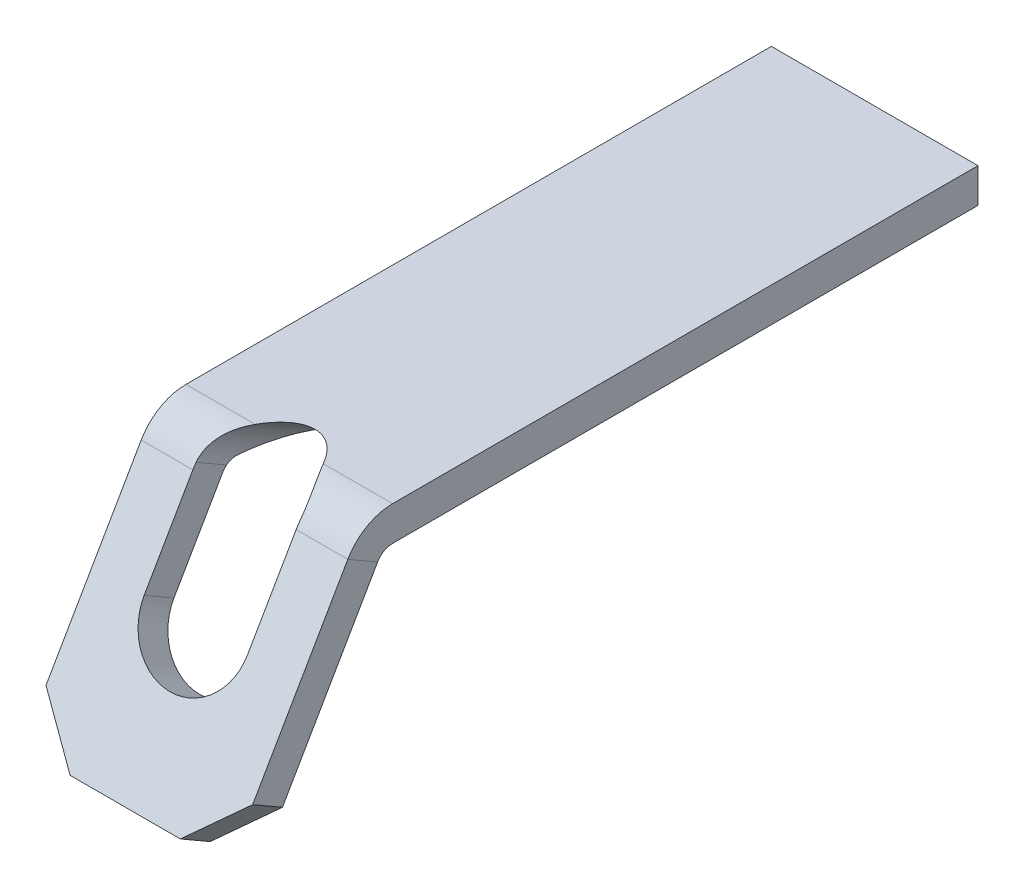
ISO-10303-21;
HEADER;
FILE_DESCRIPTION(('STEP AP214'),'2;1');
FILE_NAME('part.step','',(''),(''),'','','');
FILE_SCHEMA(('AUTOMOTIVE_DESIGN { 1 0 10303 214 1 1 1 1 }'));
ENDSEC;
DATA;
#1=APPLICATION_CONTEXT('core data for automotive mechanical design processes');
#2=APPLICATION_PROTOCOL_DEFINITION('international standard','automotive_design',2000,#1);
#3=PRODUCT_CONTEXT('',#1,'mechanical');
#4=PRODUCT('Part','Part','',(#3));
#5=PRODUCT_RELATED_PRODUCT_CATEGORY('part','',(#4));
#6=PRODUCT_DEFINITION_FORMATION('','',#4);
#7=PRODUCT_DEFINITION_CONTEXT('part definition',#1,'design');
#8=PRODUCT_DEFINITION('design','',#6,#7);
#9=PRODUCT_DEFINITION_SHAPE('','',#8);
#10=(LENGTH_UNIT() NAMED_UNIT(*) SI_UNIT(.MILLI.,.METRE.));
#11=(NAMED_UNIT(*) PLANE_ANGLE_UNIT() SI_UNIT($,.RADIAN.));
#12=(NAMED_UNIT(*) SI_UNIT($,.STERADIAN.) SOLID_ANGLE_UNIT());
#13=UNCERTAINTY_MEASURE_WITH_UNIT(LENGTH_MEASURE(1.E-05),#10,'distance_accuracy_value','');
#14=(GEOMETRIC_REPRESENTATION_CONTEXT(3) GLOBAL_UNCERTAINTY_ASSIGNED_CONTEXT((#13)) GLOBAL_UNIT_ASSIGNED_CONTEXT((#10,
#11,#12)) REPRESENTATION_CONTEXT('',''));
#15=CARTESIAN_POINT('',(0.,0.,0.));
#16=DIRECTION('',(0.,0.,1.));
#17=DIRECTION('',(1.,0.,0.));
#18=AXIS2_PLACEMENT_3D('',#15,#16,#17);
#19=CARTESIAN_POINT('',(0.,-0.5,4.25));
#20=DIRECTION('',(1.,0.,0.));
#21=DIRECTION('',(0.,0.,-1.));
#22=AXIS2_PLACEMENT_3D('',#19,#20,#21);
#23=CYLINDRICAL_SURFACE('',#22,0.25);
#24=CARTESIAN_POINT('',(0.738540154084688,-0.25,4.25));
#25=CARTESIAN_POINT('',(0.739796227190586,-0.249992222476748,4.26423192600012));
#26=CARTESIAN_POINT('',(0.741136393695474,-0.251215674942695,4.27845228618072));
#27=CARTESIAN_POINT('',(0.743704492818735,-0.255982139403662,4.30608304503192));
#28=CARTESIAN_POINT('',(0.74493454642555,-0.2594573169147,4.31950497559517));
#29=CARTESIAN_POINT('',(0.747172335123278,-0.268891956089954,4.34646595481917));
#30=CARTESIAN_POINT('',(0.748160348429003,-0.274998607282581,4.35995559261057));
#31=CARTESIAN_POINT('',(0.749588900459598,-0.289725386987503,4.38608332336731));
#32=CARTESIAN_POINT('',(0.750011148585141,-0.298418856822308,4.3986810266524));
#33=CARTESIAN_POINT('',(0.75,-0.308220009215909,4.41037591818866));
#34=B_SPLINE_CURVE_WITH_KNOTS('',3,(#24,#25,#26,#27,#28,#29,#30,#31,#32,#33),.UNSPECIFIED.,.F.,
.F.,(4,2,2,2,4),(0.,0.0428026914059938,0.0843723717900828,0.128652135829097,0.174331417159321),.UNSPECIFIED.);
#35=CARTESIAN_POINT('',(0.738540154084688,-0.25,4.25));
#36=VERTEX_POINT('',#35);
#37=CARTESIAN_POINT('',(0.75,-0.308220009215908,4.41037591818866));
#38=VERTEX_POINT('',#37);
#39=EDGE_CURVE('E322',#36,#38,#34,.T.);
#40=ORIENTED_EDGE('',*,*,#39,.F.);
#41=DIRECTION('',(1.,0.,0.));
#42=VECTOR('',#41,1.);
#43=CARTESIAN_POINT('',(-1.5,-0.25,4.25));
#44=LINE('',#43,#42);
#45=CARTESIAN_POINT('',(1.5,-0.25,4.25));
#46=VERTEX_POINT('',#45);
#47=EDGE_CURVE('E321',#36,#46,#44,.T.);
#48=ORIENTED_EDGE('',*,*,#47,.T.);
#49=CARTESIAN_POINT('',(1.5,-0.5,4.25));
#50=DIRECTION('',(1.,0.,0.));
#51=DIRECTION('',(0.,1.,0.));
#52=AXIS2_PLACEMENT_3D('',#49,#50,#51);
#53=CIRCLE('',#52,0.25);
#54=CARTESIAN_POINT('',(1.5,-0.375,4.46650635094611));
#55=VERTEX_POINT('',#54);
#56=EDGE_CURVE('E348',#46,#55,#53,.T.);
#57=ORIENTED_EDGE('',*,*,#56,.T.);
#58=DIRECTION('',(1.,0.,0.));
#59=VECTOR('',#58,1.);
#60=CARTESIAN_POINT('',(-1.5,-0.375,4.46650635094611));
#61=LINE('',#60,#59);
#62=CARTESIAN_POINT('',(0.75,-0.375,4.46650635094611));
#63=VERTEX_POINT('',#62);
#64=EDGE_CURVE('E337',#63,#55,#61,.T.);
#65=ORIENTED_EDGE('',*,*,#64,.F.);
#66=CARTESIAN_POINT('',(0.75,-0.5,4.25));
#67=DIRECTION('',(1.,0.,0.));
#68=DIRECTION('',(0.,0.,-1.));
#69=AXIS2_PLACEMENT_3D('',#66,#67,#68);
#70=CIRCLE('',#69,0.25);
#71=EDGE_CURVE('E208',#38,#63,#70,.T.);
#72=ORIENTED_EDGE('',*,*,#71,.F.);
#73=EDGE_LOOP('',(#40,#48,#57,#65,#72));
#74=FACE_BOUND('',#73,.T.);
#75=ADVANCED_FACE('F37',(#74),#23,.F.);
#76=CARTESIAN_POINT('',(0.,-0.5,4.25));
#77=DIRECTION('',(1.,0.,0.));
#78=DIRECTION('',(0.,0.,-1.));
#79=AXIS2_PLACEMENT_3D('',#76,#77,#78);
#80=CYLINDRICAL_SURFACE('',#79,0.75);
#81=CARTESIAN_POINT('',(0.75,-0.0530774463347981,4.85229580027208));
#82=CARTESIAN_POINT('',(0.750002475309161,-0.0390500007812527,4.84189012408484));
#83=CARTESIAN_POINT('',(0.749397484850658,-0.0253996458115997,4.83099771523583));
#84=CARTESIAN_POINT('',(0.747030547301498,0.00104006971930772,4.8083555069125));
#85=CARTESIAN_POINT('',(0.745269813605595,0.0138303177827564,4.79660661812892));
#86=CARTESIAN_POINT('',(0.738388136393959,0.0505308719127275,4.7604737016062));
#87=CARTESIAN_POINT('',(0.731665075692414,0.0730740166895009,4.73497676608455));
#88=CARTESIAN_POINT('',(0.714670479663492,0.113924752364809,4.68210224166803));
#89=CARTESIAN_POINT('',(0.704412929418581,0.132248568388786,4.65473240041221));
#90=CARTESIAN_POINT('',(0.681092480512217,0.164811508788652,4.59868326911695));
#91=CARTESIAN_POINT('',(0.668020265449992,0.179036692146175,4.56999988576025));
#92=CARTESIAN_POINT('',(0.63361768347433,0.2088635379017,4.49914580377907));
#93=CARTESIAN_POINT('',(0.611187373419911,0.222307050936848,4.45660414355653));
#94=CARTESIAN_POINT('',(0.564129396140941,0.241456718121171,4.37110856302409));
#95=CARTESIAN_POINT('',(0.539503361307708,0.247168570016325,4.3281549698181));
#96=CARTESIAN_POINT('',(0.508168812013807,0.249724148600028,4.27340370863223));
#97=CARTESIAN_POINT('',(0.501476538124168,0.249996949131605,4.26170462495713));
#98=CARTESIAN_POINT('',(0.494804752028709,0.250000000000006,4.25));
#99=B_SPLINE_CURVE_WITH_KNOTS('',3,(#81,#82,#83,#84,#85,#86,#87,#88,#89,#90,#91,#92,#93,#94,#95,
#96,#97,#98),.UNSPECIFIED.,.F.,.F.,(4,2,2,2,2,2,2,2,4),(0.,0.0523524240966635,0.104649972016483,
0.208128032232243,0.311201270134959,0.4146210689264,0.563636486235141,0.712542028697262,
0.752971410406567),.UNSPECIFIED.);
#100=CARTESIAN_POINT('',(0.75,-0.0530774463347985,4.85229580027207));
#101=VERTEX_POINT('',#100);
#102=CARTESIAN_POINT('',(0.494804752028707,0.25,4.25));
#103=VERTEX_POINT('',#102);
#104=EDGE_CURVE('E247',#101,#103,#99,.T.);
#105=ORIENTED_EDGE('',*,*,#104,.F.);
#106=CARTESIAN_POINT('',(0.75,-0.5,4.25));
#107=DIRECTION('',(1.,0.,0.));
#108=DIRECTION('',(0.,0.,-1.));
#109=AXIS2_PLACEMENT_3D('',#106,#107,#108);
#110=CIRCLE('',#109,0.75);
#111=CARTESIAN_POINT('',(0.75,-0.125000000000001,4.89951905283833));
#112=VERTEX_POINT('',#111);
#113=EDGE_CURVE('E210',#112,#101,#110,.F.);
#114=ORIENTED_EDGE('',*,*,#113,.F.);
#115=DIRECTION('',(-1.,0.,0.));
#116=VECTOR('',#115,1.);
#117=CARTESIAN_POINT('',(1.5,-0.125000000000001,4.89951905283833));
#118=LINE('',#117,#116);
#119=CARTESIAN_POINT('',(1.5,-0.125000000000001,4.89951905283833));
#120=VERTEX_POINT('',#119);
#121=EDGE_CURVE('E345',#120,#112,#118,.T.);
#122=ORIENTED_EDGE('',*,*,#121,.F.);
#123=CARTESIAN_POINT('',(1.5,-0.5,4.25));
#124=DIRECTION('',(1.,0.,0.));
#125=DIRECTION('',(0.,1.,0.));
#126=AXIS2_PLACEMENT_3D('',#123,#124,#125);
#127=CIRCLE('',#126,0.75);
#128=CARTESIAN_POINT('',(1.5,0.25,4.25));
#129=VERTEX_POINT('',#128);
#130=EDGE_CURVE('E359',#129,#120,#127,.T.);
#131=ORIENTED_EDGE('',*,*,#130,.F.);
#132=DIRECTION('',(1.,0.,0.));
#133=VECTOR('',#132,1.);
#134=CARTESIAN_POINT('',(-1.5,0.25,4.25));
#135=LINE('',#134,#133);
#136=EDGE_CURVE('E376',#103,#129,#135,.T.);
#137=ORIENTED_EDGE('',*,*,#136,.F.);
#138=EDGE_LOOP('',(#105,#114,#122,#131,#137));
#139=FACE_BOUND('',#138,.T.);
#140=ADVANCED_FACE('F261',(#139),#80,.T.);
#141=CARTESIAN_POINT('',(1.5,0.25,-4.25));
#142=DIRECTION('',(-1.,0.,0.));
#143=DIRECTION('',(0.,0.,1.));
#144=AXIS2_PLACEMENT_3D('',#141,#142,#143);
#145=PLANE('',#144);
#146=DIRECTION('',(0.,0.,-1.));
#147=VECTOR('',#146,1.);
#148=CARTESIAN_POINT('',(1.5,-0.25,-4.25));
#149=LINE('',#148,#147);
#150=CARTESIAN_POINT('',(1.5,-0.25,-4.25));
#151=VERTEX_POINT('',#150);
#152=EDGE_CURVE('E368',#46,#151,#149,.T.);
#153=ORIENTED_EDGE('',*,*,#152,.T.);
#154=DIRECTION('',(0.,-1.,0.));
#155=VECTOR('',#154,1.);
#156=CARTESIAN_POINT('',(1.5,0.25,-4.25));
#157=LINE('',#156,#155);
#158=CARTESIAN_POINT('',(1.5,0.25,-4.25));
#159=VERTEX_POINT('',#158);
#160=EDGE_CURVE('E186',#159,#151,#157,.T.);
#161=ORIENTED_EDGE('',*,*,#160,.F.);
#162=DIRECTION('',(0.,0.,-1.));
#163=VECTOR('',#162,1.);
#164=CARTESIAN_POINT('',(1.5,0.25,-4.25));
#165=LINE('',#164,#163);
#166=EDGE_CURVE('E369',#129,#159,#165,.T.);
#167=ORIENTED_EDGE('',*,*,#166,.F.);
#168=ORIENTED_EDGE('',*,*,#130,.T.);
#169=DIRECTION('',(0.,0.5,0.866025403784439));
#170=VECTOR('',#169,1.);
#171=CARTESIAN_POINT('',(1.5,-0.375,4.46650635094611));
#172=LINE('',#171,#170);
#173=EDGE_CURVE('E351',#55,#120,#172,.T.);
#174=ORIENTED_EDGE('',*,*,#173,.F.);
#175=ORIENTED_EDGE('',*,*,#56,.F.);
#176=EDGE_LOOP('',(#153,#161,#167,#168,#174,#175));
#177=FACE_BOUND('',#176,.T.);
#178=ADVANCED_FACE('F284',(#177),#145,.F.);
#179=CARTESIAN_POINT('',(-1.5,0.25,-4.25));
#180=DIRECTION('',(0.,0.,1.));
#181=DIRECTION('',(1.,0.,0.));
#182=AXIS2_PLACEMENT_3D('',#179,#180,#181);
#183=PLANE('',#182);
#184=DIRECTION('',(-1.,0.,0.));
#185=VECTOR('',#184,1.);
#186=CARTESIAN_POINT('',(-1.5,-0.25,-4.25));
#187=LINE('',#186,#185);
#188=CARTESIAN_POINT('',(-1.5,-0.25,-4.25));
#189=VERTEX_POINT('',#188);
#190=EDGE_CURVE('E383',#151,#189,#187,.T.);
#191=ORIENTED_EDGE('',*,*,#190,.T.);
#192=DIRECTION('',(0.,-1.,0.));
#193=VECTOR('',#192,1.);
#194=CARTESIAN_POINT('',(-1.5,0.25,-4.25));
#195=LINE('',#194,#193);
#196=CARTESIAN_POINT('',(-1.5,0.25,-4.25));
#197=VERTEX_POINT('',#196);
#198=EDGE_CURVE('E380',#197,#189,#195,.T.);
#199=ORIENTED_EDGE('',*,*,#198,.F.);
#200=DIRECTION('',(-1.,0.,0.));
#201=VECTOR('',#200,1.);
#202=CARTESIAN_POINT('',(-1.5,0.25,-4.25));
#203=LINE('',#202,#201);
#204=EDGE_CURVE('E372',#159,#197,#203,.T.);
#205=ORIENTED_EDGE('',*,*,#204,.F.);
#206=ORIENTED_EDGE('',*,*,#160,.T.);
#207=EDGE_LOOP('',(#191,#199,#205,#206));
#208=FACE_BOUND('',#207,.T.);
#209=ADVANCED_FACE('F280',(#208),#183,.F.);
#210=CARTESIAN_POINT('',(-1.5,0.25,-4.25));
#211=DIRECTION('',(1.,0.,0.));
#212=DIRECTION('',(0.,0.,-1.));
#213=AXIS2_PLACEMENT_3D('',#210,#211,#212);
#214=PLANE('',#213);
#215=DIRECTION('',(0.,0.,1.));
#216=VECTOR('',#215,1.);
#217=CARTESIAN_POINT('',(-1.5,-0.25,-4.25));
#218=LINE('',#217,#216);
#219=CARTESIAN_POINT('',(-1.5,-0.25,4.25));
#220=VERTEX_POINT('',#219);
#221=EDGE_CURVE('E385',#189,#220,#218,.T.);
#222=ORIENTED_EDGE('',*,*,#221,.T.);
#223=CARTESIAN_POINT('',(-1.5,-0.5,4.25));
#224=DIRECTION('',(1.,0.,0.));
#225=DIRECTION('',(0.,1.,0.));
#226=AXIS2_PLACEMENT_3D('',#223,#224,#225);
#227=CIRCLE('',#226,0.25);
#228=CARTESIAN_POINT('',(-1.5,-0.375,4.46650635094611));
#229=VERTEX_POINT('',#228);
#230=EDGE_CURVE('E335',#220,#229,#227,.T.);
#231=ORIENTED_EDGE('',*,*,#230,.T.);
#232=DIRECTION('',(0.,-0.5,-0.866025403784439));
#233=VECTOR('',#232,1.);
#234=CARTESIAN_POINT('',(-1.5,-0.125000000000001,4.89951905283833));
#235=LINE('',#234,#233);
#236=CARTESIAN_POINT('',(-1.5,-0.125000000000001,4.89951905283833));
#237=VERTEX_POINT('',#236);
#238=EDGE_CURVE('E326',#237,#229,#235,.T.);
#239=ORIENTED_EDGE('',*,*,#238,.F.);
#240=CARTESIAN_POINT('',(-1.5,-0.5,4.25));
#241=DIRECTION('',(1.,0.,0.));
#242=DIRECTION('',(0.,1.,0.));
#243=AXIS2_PLACEMENT_3D('',#240,#241,#242);
#244=CIRCLE('',#243,0.75);
#245=CARTESIAN_POINT('',(-1.5,0.25,4.25));
#246=VERTEX_POINT('',#245);
#247=EDGE_CURVE('E323',#246,#237,#244,.T.);
#248=ORIENTED_EDGE('',*,*,#247,.F.);
#249=DIRECTION('',(0.,0.,1.));
#250=VECTOR('',#249,1.);
#251=CARTESIAN_POINT('',(-1.5,0.25,-4.25));
#252=LINE('',#251,#250);
#253=EDGE_CURVE('E374',#197,#246,#252,.T.);
#254=ORIENTED_EDGE('',*,*,#253,.F.);
#255=ORIENTED_EDGE('',*,*,#198,.T.);
#256=EDGE_LOOP('',(#222,#231,#239,#248,#254,#255));
#257=FACE_BOUND('',#256,.T.);
#258=ADVANCED_FACE('F273',(#257),#214,.F.);
#259=CARTESIAN_POINT('',(0.,0.25,0.));
#260=DIRECTION('',(0.,1.,0.));
#261=DIRECTION('',(0.,0.,1.));
#262=AXIS2_PLACEMENT_3D('',#259,#260,#261);
#263=PLANE('',#262);
#264=CARTESIAN_POINT('',(0.,0.25,5.37724133595217));
#265=DIRECTION('',(0.,1.,0.));
#266=DIRECTION('',(0.,0.,1.));
#267=AXIS2_PLACEMENT_3D('',#264,#265,#266);
#268=ELLIPSE('',#267,1.5,0.75);
#269=CARTESIAN_POINT('',(-0.494804752028707,0.25,4.25));
#270=VERTEX_POINT('',#269);
#271=EDGE_CURVE('E212',#103,#270,#268,.T.);
#272=ORIENTED_EDGE('',*,*,#271,.F.);
#273=ORIENTED_EDGE('',*,*,#136,.T.);
#274=ORIENTED_EDGE('',*,*,#166,.T.);
#275=ORIENTED_EDGE('',*,*,#204,.T.);
#276=ORIENTED_EDGE('',*,*,#253,.T.);
#277=EDGE_CURVE('E377',#246,#270,#135,.T.);
#278=ORIENTED_EDGE('',*,*,#277,.T.);
#279=EDGE_LOOP('',(#272,#273,#274,#275,#276,#278));
#280=FACE_BOUND('',#279,.T.);
#281=ADVANCED_FACE('F270',(#280),#263,.T.);
#282=CARTESIAN_POINT('',(0.,-0.25,0.));
#283=DIRECTION('',(0.,1.,0.));
#284=DIRECTION('',(0.,0.,1.));
#285=AXIS2_PLACEMENT_3D('',#282,#283,#284);
#286=PLANE('',#285);
#287=ORIENTED_EDGE('',*,*,#47,.F.);
#288=CARTESIAN_POINT('',(0.,-0.25,4.51121593216774));
#289=DIRECTION('',(0.,1.,0.));
#290=DIRECTION('',(0.,0.,1.));
#291=AXIS2_PLACEMENT_3D('',#288,#289,#290);
#292=ELLIPSE('',#291,1.5,0.75);
#293=CARTESIAN_POINT('',(-0.738540154084688,-0.25,4.25));
#294=VERTEX_POINT('',#293);
#295=EDGE_CURVE('E222',#36,#294,#292,.T.);
#296=ORIENTED_EDGE('',*,*,#295,.T.);
#297=EDGE_CURVE('E314',#220,#294,#44,.T.);
#298=ORIENTED_EDGE('',*,*,#297,.F.);
#299=ORIENTED_EDGE('',*,*,#221,.F.);
#300=ORIENTED_EDGE('',*,*,#190,.F.);
#301=ORIENTED_EDGE('',*,*,#152,.F.);
#302=EDGE_LOOP('',(#287,#296,#298,#299,#300,#301));
#303=FACE_BOUND('',#302,.T.);
#304=ADVANCED_FACE('F266',(#303),#286,.F.);
#305=CARTESIAN_POINT('',(0.,-3.25,6.4150635094611));
#306=DIRECTION('',(0.,-0.866025403784438,0.500000000000001));
#307=DIRECTION('',(1.,0.,0.));
#308=AXIS2_PLACEMENT_3D('',#305,#306,#307);
#309=PLANE('',#308);
#310=DIRECTION('',(1.,0.,0.));
#311=VECTOR('',#310,1.);
#312=CARTESIAN_POINT('',(-1.5,-3.375,6.198557158515));
#313=LINE('',#312,#311);
#314=CARTESIAN_POINT('',(-0.799999999999998,-3.375,6.198557158515));
#315=VERTEX_POINT('',#314);
#316=CARTESIAN_POINT('',(0.8,-3.375,6.198557158515));
#317=VERTEX_POINT('',#316);
#318=EDGE_CURVE('E341',#315,#317,#313,.T.);
#319=ORIENTED_EDGE('',*,*,#318,.T.);
#320=DIRECTION('',(0.,0.500000000000001,0.866025403784438));
#321=VECTOR('',#320,1.);
#322=CARTESIAN_POINT('',(0.8,-3.25,6.4150635094611));
#323=LINE('',#322,#321);
#324=CARTESIAN_POINT('',(0.8,-3.125,6.63156986040721));
#325=VERTEX_POINT('',#324);
#326=EDGE_CURVE('E407',#317,#325,#323,.T.);
#327=ORIENTED_EDGE('',*,*,#326,.T.);
#328=DIRECTION('',(-1.,0.,0.));
#329=VECTOR('',#328,1.);
#330=CARTESIAN_POINT('',(1.5,-3.125,6.63156986040721));
#331=LINE('',#330,#329);
#332=CARTESIAN_POINT('',(-0.799999999999998,-3.125,6.63156986040721));
#333=VERTEX_POINT('',#332);
#334=EDGE_CURVE('E364',#325,#333,#331,.T.);
#335=ORIENTED_EDGE('',*,*,#334,.T.);
#336=DIRECTION('',(0.,-0.500000000000001,-0.866025403784438));
#337=VECTOR('',#336,1.);
#338=CARTESIAN_POINT('',(-0.799999999999998,-3.25,6.4150635094611));
#339=LINE('',#338,#337);
#340=EDGE_CURVE('E253',#333,#315,#339,.T.);
#341=ORIENTED_EDGE('',*,*,#340,.T.);
#342=EDGE_LOOP('',(#319,#327,#335,#341));
#343=FACE_BOUND('',#342,.T.);
#344=ADVANCED_FACE('F234',(#343),#309,.T.);
#345=CARTESIAN_POINT('',(-0.75,-0.308220009215908,4.41037591818866));
#346=CARTESIAN_POINT('',(-0.750008310530121,-0.299170345690206,4.39957110118343));
#347=CARTESIAN_POINT('',(-0.7496493719506,-0.291061551564701,4.38799997393136));
#348=CARTESIAN_POINT('',(-0.748415678099862,-0.277104423632904,4.36403100034418));
#349=CARTESIAN_POINT('',(-0.747555891577427,-0.271198332145317,4.35166604883466));
#350=CARTESIAN_POINT('',(-0.745421239101967,-0.261037124809497,4.32496342703673));
#351=CARTESIAN_POINT('',(-0.744115010283401,-0.256988760900442,4.31054949871758));
#352=CARTESIAN_POINT('',(-0.741355473168162,-0.25142101625551,4.28077071335262));
#353=CARTESIAN_POINT('',(-0.739898791250124,-0.249986913345264,4.26539018443887));
#354=CARTESIAN_POINT('',(-0.738540154084688,-0.25,4.25));
#355=B_SPLINE_CURVE_WITH_KNOTS('',3,(#345,#346,#347,#348,#349,#350,#351,#352,#353,#354),
.UNSPECIFIED.,.F.,.F.,(4,2,2,2,4),(0.,0.0422016336722642,0.0832023760305246,0.128047888733355,
0.174331752280167),.UNSPECIFIED.);
#356=CARTESIAN_POINT('',(-0.75,-0.308220009215908,4.41037591818866));
#357=VERTEX_POINT('',#356);
#358=EDGE_CURVE('E214',#357,#294,#355,.T.);
#359=ORIENTED_EDGE('',*,*,#358,.F.);
#360=CARTESIAN_POINT('',(-0.75,-0.5,4.25));
#361=DIRECTION('',(-1.,0.,0.));
#362=DIRECTION('',(0.,-1.,0.));
#363=AXIS2_PLACEMENT_3D('',#360,#361,#362);
#364=CIRCLE('',#363,0.25);
#365=CARTESIAN_POINT('',(-0.75,-0.375,4.46650635094611));
#366=VERTEX_POINT('',#365);
#367=EDGE_CURVE('E202',#366,#357,#364,.T.);
#368=ORIENTED_EDGE('',*,*,#367,.F.);
#369=EDGE_CURVE('E346',#229,#366,#61,.T.);
#370=ORIENTED_EDGE('',*,*,#369,.F.);
#371=ORIENTED_EDGE('',*,*,#230,.F.);
#372=ORIENTED_EDGE('',*,*,#297,.T.);
#373=EDGE_LOOP('',(#359,#368,#370,#371,#372));
#374=FACE_BOUND('',#373,.T.);
#375=ADVANCED_FACE('F224',(#374),#23,.F.);
#376=CARTESIAN_POINT('',(-0.494804752028707,0.25,4.25));
#377=CARTESIAN_POINT('',(-0.507212223849995,0.24999104936502,4.27176544478382));
#378=CARTESIAN_POINT('',(-0.519677329562981,0.249052174133644,4.29348153759597));
#379=CARTESIAN_POINT('',(-0.544476505895984,0.245273819176751,4.33686353730328));
#380=CARTESIAN_POINT('',(-0.556810364065535,0.242431628285439,4.35852932830796));
#381=CARTESIAN_POINT('',(-0.593492984985001,0.230897623169133,4.42397071088134));
#382=CARTESIAN_POINT('',(-0.617199549117097,0.219196023208876,4.46764754407431));
#383=CARTESIAN_POINT('',(-0.655369353049871,0.191156681794535,4.54326612847591));
#384=CARTESIAN_POINT('',(-0.670675057728904,0.176653514513336,4.57546468892482));
#385=CARTESIAN_POINT('',(-0.697958612412823,0.142647605295805,4.63828922937357));
#386=CARTESIAN_POINT('',(-0.70996212874235,0.123185827280292,4.66892573721418));
#387=CARTESIAN_POINT('',(-0.729340509733132,0.0800406667948656,4.72675752132392));
#388=CARTESIAN_POINT('',(-0.736878604418717,0.0565530386505959,4.75404068185705));
#389=CARTESIAN_POINT('',(-0.744635583122395,0.0179834450445735,4.79270929564723));
#390=CARTESIAN_POINT('',(-0.746630830911752,0.00444936512402553,4.80531366677174));
#391=CARTESIAN_POINT('',(-0.749315579530813,-0.0236048687245404,4.82956257178275));
#392=CARTESIAN_POINT('',(-0.750003338619623,-0.0381263113268377,4.84120580560175));
#393=CARTESIAN_POINT('',(-0.75,-0.0530774463347993,4.85229580027208));
#394=B_SPLINE_CURVE_WITH_KNOTS('',3,(#376,#377,#378,#379,#380,#381,#382,#383,#384,#385,#386,
#387,#388,#389,#390,#391,#392,#393),.UNSPECIFIED.,.F.,.F.,(4,2,2,2,2,2,2,2,4),(0.,
0.0751135104377852,0.150334244069228,0.302651785589941,0.417705443137115,0.531837811097346,
0.641489009411778,0.697207014432039,0.752999191038594),.UNSPECIFIED.);
#395=CARTESIAN_POINT('',(-0.75,-0.0530774463347985,4.85229580027207));
#396=VERTEX_POINT('',#395);
#397=EDGE_CURVE('E185',#270,#396,#394,.T.);
#398=ORIENTED_EDGE('',*,*,#397,.F.);
#399=ORIENTED_EDGE('',*,*,#277,.F.);
#400=ORIENTED_EDGE('',*,*,#247,.T.);
#401=CARTESIAN_POINT('',(-0.75,-0.125000000000001,4.89951905283833));
#402=VERTEX_POINT('',#401);
#403=EDGE_CURVE('E362',#402,#237,#118,.T.);
#404=ORIENTED_EDGE('',*,*,#403,.F.);
#405=CARTESIAN_POINT('',(-0.75,-0.5,4.25));
#406=DIRECTION('',(-1.,0.,0.));
#407=DIRECTION('',(0.,-1.,0.));
#408=AXIS2_PLACEMENT_3D('',#405,#406,#407);
#409=CIRCLE('',#408,0.75);
#410=EDGE_CURVE('E182',#396,#402,#409,.F.);
#411=ORIENTED_EDGE('',*,*,#410,.F.);
#412=EDGE_LOOP('',(#398,#399,#400,#404,#411));
#413=FACE_BOUND('',#412,.T.);
#414=ADVANCED_FACE('F255',(#413),#80,.T.);
#415=CARTESIAN_POINT('',(-1.5,-0.125,4.89951905283833));
#416=DIRECTION('',(-1.,0.,0.));
#417=DIRECTION('',(0.,0.,1.));
#418=AXIS2_PLACEMENT_3D('',#415,#416,#417);
#419=PLANE('',#418);
#420=DIRECTION('',(0.,-0.866025403784438,0.500000000000001));
#421=VECTOR('',#420,1.);
#422=CARTESIAN_POINT('',(-1.5,-0.375,4.46650635094611));
#423=LINE('',#422,#421);
#424=CARTESIAN_POINT('',(-1.5,-2.76878221735089,5.84855715851499));
#425=VERTEX_POINT('',#424);
#426=EDGE_CURVE('E339',#229,#425,#423,.T.);
#427=ORIENTED_EDGE('',*,*,#426,.T.);
#428=DIRECTION('',(0.,0.500000000000001,0.866025403784438));
#429=VECTOR('',#428,1.);
#430=CARTESIAN_POINT('',(-1.5,-2.51878221735089,6.28156986040721));
#431=LINE('',#430,#429);
#432=CARTESIAN_POINT('',(-1.5,-2.51878221735089,6.28156986040721));
#433=VERTEX_POINT('',#432);
#434=EDGE_CURVE('E11',#425,#433,#431,.T.);
#435=ORIENTED_EDGE('',*,*,#434,.T.);
#436=DIRECTION('',(0.,-0.866025403784438,0.500000000000001));
#437=VECTOR('',#436,1.);
#438=CARTESIAN_POINT('',(-1.5,-0.125,4.89951905283833));
#439=LINE('',#438,#437);
#440=EDGE_CURVE('E342',#237,#433,#439,.T.);
#441=ORIENTED_EDGE('',*,*,#440,.F.);
#442=ORIENTED_EDGE('',*,*,#238,.T.);
#443=EDGE_LOOP('',(#427,#435,#441,#442));
#444=FACE_BOUND('',#443,.T.);
#445=ADVANCED_FACE('F236',(#444),#419,.T.);
#446=CARTESIAN_POINT('',(-1.5,-0.375,4.46650635094611));
#447=DIRECTION('',(0.,-0.500000000000001,-0.866025403784438));
#448=DIRECTION('',(0.,0.866025403784438,-0.500000000000001));
#449=AXIS2_PLACEMENT_3D('',#446,#447,#448);
#450=PLANE('',#449);
#451=DIRECTION('',(0.,-0.866025403784438,0.500000000000001));
#452=VECTOR('',#451,1.);
#453=CARTESIAN_POINT('',(1.5,-0.375,4.46650635094611));
#454=LINE('',#453,#452);
#455=CARTESIAN_POINT('',(1.5,-2.76878221735089,5.84855715851499));
#456=VERTEX_POINT('',#455);
#457=EDGE_CURVE('E354',#55,#456,#454,.T.);
#458=ORIENTED_EDGE('',*,*,#457,.T.);
#459=DIRECTION('',(0.707106781186546,0.612372435695796,-0.353553390593275));
#460=VECTOR('',#459,1.);
#461=CARTESIAN_POINT('',(1.38205080756888,-2.8709292143521,5.90753175473055));
#462=LINE('',#461,#460);
#463=EDGE_CURVE('E45',#456,#317,#462,.F.);
#464=ORIENTED_EDGE('',*,*,#463,.T.);
#465=ORIENTED_EDGE('',*,*,#318,.F.);
#466=DIRECTION('',(0.707106781186546,-0.612372435695796,0.353553390593275));
#467=VECTOR('',#466,1.);
#468=CARTESIAN_POINT('',(-2.88205080756888,-1.57189110867544,5.15753175473055));
#469=LINE('',#468,#467);
#470=EDGE_CURVE('E52',#315,#425,#469,.F.);
#471=ORIENTED_EDGE('',*,*,#470,.T.);
#472=ORIENTED_EDGE('',*,*,#426,.F.);
#473=ORIENTED_EDGE('',*,*,#369,.T.);
#474=DIRECTION('',(0.,0.866025403784438,-0.500000000000001));
#475=VECTOR('',#474,1.);
#476=CARTESIAN_POINT('',(-0.75,-0.375,4.46650635094611));
#477=LINE('',#476,#475);
#478=CARTESIAN_POINT('',(-0.75,-1.5996479222419,5.17355715851499));
#479=VERTEX_POINT('',#478);
#480=EDGE_CURVE('E198',#479,#366,#477,.T.);
#481=ORIENTED_EDGE('',*,*,#480,.F.);
#482=CARTESIAN_POINT('',(0.,-1.5996479222419,5.17355715851499));
#483=DIRECTION('',(0.,-0.500000000000001,-0.866025403784438));
#484=DIRECTION('',(0.,0.866025403784438,-0.500000000000001));
#485=AXIS2_PLACEMENT_3D('',#482,#483,#484);
#486=CIRCLE('',#485,0.75);
#487=CARTESIAN_POINT('',(0.75,-1.5996479222419,5.17355715851499));
#488=VERTEX_POINT('',#487);
#489=EDGE_CURVE('E171',#488,#479,#486,.T.);
#490=ORIENTED_EDGE('',*,*,#489,.F.);
#491=DIRECTION('',(0.,-0.866025403784438,0.500000000000001));
#492=VECTOR('',#491,1.);
#493=CARTESIAN_POINT('',(0.75,-0.375,4.46650635094611));
#494=LINE('',#493,#492);
#495=EDGE_CURVE('E206',#63,#488,#494,.T.);
#496=ORIENTED_EDGE('',*,*,#495,.F.);
#497=ORIENTED_EDGE('',*,*,#64,.T.);
#498=EDGE_LOOP('',(#458,#464,#465,#471,#472,#473,#481,#490,#496,#497));
#499=FACE_BOUND('',#498,.T.);
#500=ADVANCED_FACE('F398',(#499),#450,.T.);
#501=CARTESIAN_POINT('',(1.5,-0.375,4.46650635094611));
#502=DIRECTION('',(1.,0.,0.));
#503=DIRECTION('',(0.,0.,-1.));
#504=AXIS2_PLACEMENT_3D('',#501,#502,#503);
#505=PLANE('',#504);
#506=DIRECTION('',(0.,-0.866025403784438,0.500000000000001));
#507=VECTOR('',#506,1.);
#508=CARTESIAN_POINT('',(1.5,-0.125,4.89951905283833));
#509=LINE('',#508,#507);
#510=CARTESIAN_POINT('',(1.5,-2.51878221735089,6.28156986040721));
#511=VERTEX_POINT('',#510);
#512=EDGE_CURVE('E356',#120,#511,#509,.T.);
#513=ORIENTED_EDGE('',*,*,#512,.T.);
#514=DIRECTION('',(0.,-0.500000000000001,-0.866025403784438));
#515=VECTOR('',#514,1.);
#516=CARTESIAN_POINT('',(1.5,-2.76878221735089,5.84855715851499));
#517=LINE('',#516,#515);
#518=EDGE_CURVE('E60',#511,#456,#517,.T.);
#519=ORIENTED_EDGE('',*,*,#518,.T.);
#520=ORIENTED_EDGE('',*,*,#457,.F.);
#521=ORIENTED_EDGE('',*,*,#173,.T.);
#522=EDGE_LOOP('',(#513,#519,#520,#521));
#523=FACE_BOUND('',#522,.T.);
#524=ADVANCED_FACE('F262',(#523),#505,.T.);
#525=CARTESIAN_POINT('',(1.5,-0.125,4.89951905283833));
#526=DIRECTION('',(0.,0.500000000000001,0.866025403784438));
#527=DIRECTION('',(0.,-0.866025403784438,0.500000000000001));
#528=AXIS2_PLACEMENT_3D('',#525,#526,#527);
#529=PLANE('',#528);
#530=ORIENTED_EDGE('',*,*,#334,.F.);
#531=DIRECTION('',(-0.707106781186546,-0.612372435695796,0.353553390593275));
#532=VECTOR('',#531,1.);
#533=CARTESIAN_POINT('',(2.88205080756888,-1.32189110867544,5.59054445662277));
#534=LINE('',#533,#532);
#535=EDGE_CURVE('E406',#325,#511,#534,.F.);
#536=ORIENTED_EDGE('',*,*,#535,.T.);
#537=ORIENTED_EDGE('',*,*,#512,.F.);
#538=ORIENTED_EDGE('',*,*,#121,.T.);
#539=DIRECTION('',(0.,0.866025403784438,-0.500000000000001));
#540=VECTOR('',#539,1.);
#541=CARTESIAN_POINT('',(0.75,-0.0506098165652452,4.85656986040721));
#542=LINE('',#541,#540);
#543=CARTESIAN_POINT('',(0.75,-1.3496479222419,5.60656986040721));
#544=VERTEX_POINT('',#543);
#545=EDGE_CURVE('E191',#544,#112,#542,.T.);
#546=ORIENTED_EDGE('',*,*,#545,.F.);
#547=CARTESIAN_POINT('',(0.,-1.3496479222419,5.60656986040721));
#548=DIRECTION('',(0.,0.500000000000001,0.866025403784438));
#549=DIRECTION('',(0.,-0.866025403784438,0.500000000000001));
#550=AXIS2_PLACEMENT_3D('',#547,#548,#549);
#551=CIRCLE('',#550,0.75);
#552=CARTESIAN_POINT('',(-0.75,-1.3496479222419,5.60656986040721));
#553=VERTEX_POINT('',#552);
#554=EDGE_CURVE('E168',#553,#544,#551,.T.);
#555=ORIENTED_EDGE('',*,*,#554,.F.);
#556=DIRECTION('',(0.,-0.866025403784438,0.500000000000001));
#557=VECTOR('',#556,1.);
#558=CARTESIAN_POINT('',(-0.75,-0.125,4.89951905283833));
#559=LINE('',#558,#557);
#560=EDGE_CURVE('E178',#402,#553,#559,.T.);
#561=ORIENTED_EDGE('',*,*,#560,.F.);
#562=ORIENTED_EDGE('',*,*,#403,.T.);
#563=ORIENTED_EDGE('',*,*,#440,.T.);
#564=DIRECTION('',(-0.707106781186546,0.612372435695796,-0.353553390593275));
#565=VECTOR('',#564,1.);
#566=CARTESIAN_POINT('',(-1.38205080756888,-2.6209292143521,6.34054445662277));
#567=LINE('',#566,#565);
#568=EDGE_CURVE('E405',#433,#333,#567,.F.);
#569=ORIENTED_EDGE('',*,*,#568,.T.);
#570=EDGE_LOOP('',(#530,#536,#537,#538,#546,#555,#561,#562,#563,#569));
#571=FACE_BOUND('',#570,.T.);
#572=ADVANCED_FACE('F189',(#571),#529,.T.);
#573=CARTESIAN_POINT('',(0.,-4.82496778264912,-3.41286071037125));
#574=DIRECTION('',(0.,0.500000000000001,0.866025403784438));
#575=DIRECTION('',(0.,-0.866025403784438,0.500000000000001));
#576=AXIS2_PLACEMENT_3D('',#573,#574,#575);
#577=CYLINDRICAL_SURFACE('',#576,0.75);
#578=ORIENTED_EDGE('',*,*,#39,.T.);
#579=DIRECTION('',(0.,0.500000000000001,0.866025403784438));
#580=VECTOR('',#579,1.);
#581=CARTESIAN_POINT('',(0.75,-4.82496778264912,-3.41286071037125));
#582=LINE('',#581,#580);
#583=EDGE_CURVE('E195',#38,#101,#582,.T.);
#584=ORIENTED_EDGE('',*,*,#583,.T.);
#585=ORIENTED_EDGE('',*,*,#104,.T.);
#586=ORIENTED_EDGE('',*,*,#271,.T.);
#587=ORIENTED_EDGE('',*,*,#397,.T.);
#588=DIRECTION('',(0.,0.500000000000001,0.866025403784438));
#589=VECTOR('',#588,1.);
#590=CARTESIAN_POINT('',(-0.75,-4.82496778264912,-3.41286071037125));
#591=LINE('',#590,#589);
#592=EDGE_CURVE('E175',#357,#396,#591,.T.);
#593=ORIENTED_EDGE('',*,*,#592,.F.);
#594=ORIENTED_EDGE('',*,*,#358,.T.);
#595=ORIENTED_EDGE('',*,*,#295,.F.);
#596=EDGE_LOOP('',(#578,#584,#585,#586,#587,#593,#594,#595));
#597=FACE_BOUND('',#596,.T.);
#598=ADVANCED_FACE('F228',(#597),#577,.F.);
#599=CARTESIAN_POINT('',(0.75,-4.82496778264912,-3.41286071037125));
#600=DIRECTION('',(1.,0.,0.));
#601=DIRECTION('',(0.,0.,-1.));
#602=AXIS2_PLACEMENT_3D('',#599,#600,#601);
#603=PLANE('',#602);
#604=ORIENTED_EDGE('',*,*,#113,.T.);
#605=ORIENTED_EDGE('',*,*,#583,.F.);
#606=ORIENTED_EDGE('',*,*,#71,.T.);
#607=ORIENTED_EDGE('',*,*,#495,.T.);
#608=DIRECTION('',(0.,0.500000000000001,0.866025403784438));
#609=VECTOR('',#608,1.);
#610=CARTESIAN_POINT('',(0.75,-6.12400588832578,-2.66286071037124));
#611=LINE('',#610,#609);
#612=EDGE_CURVE('E174',#488,#544,#611,.T.);
#613=ORIENTED_EDGE('',*,*,#612,.T.);
#614=ORIENTED_EDGE('',*,*,#545,.T.);
#615=EDGE_LOOP('',(#604,#605,#606,#607,#613,#614));
#616=FACE_BOUND('',#615,.T.);
#617=ADVANCED_FACE('F232',(#616),#603,.F.);
#618=CARTESIAN_POINT('',(0.,-6.12400588832578,-2.66286071037124));
#619=DIRECTION('',(0.,0.500000000000001,0.866025403784438));
#620=DIRECTION('',(0.,-0.866025403784438,0.500000000000001));
#621=AXIS2_PLACEMENT_3D('',#618,#619,#620);
#622=CYLINDRICAL_SURFACE('',#621,0.75);
#623=ORIENTED_EDGE('',*,*,#489,.T.);
#624=DIRECTION('',(0.,0.500000000000001,0.866025403784438));
#625=VECTOR('',#624,1.);
#626=CARTESIAN_POINT('',(-0.75,-6.12400588832578,-2.66286071037124));
#627=LINE('',#626,#625);
#628=EDGE_CURVE('E163',#479,#553,#627,.T.);
#629=ORIENTED_EDGE('',*,*,#628,.T.);
#630=ORIENTED_EDGE('',*,*,#554,.T.);
#631=ORIENTED_EDGE('',*,*,#612,.F.);
#632=EDGE_LOOP('',(#623,#629,#630,#631));
#633=FACE_BOUND('',#632,.T.);
#634=ADVANCED_FACE('F165',(#633),#622,.F.);
#635=CARTESIAN_POINT('',(-0.75,-4.82496778264912,-3.41286071037125));
#636=DIRECTION('',(-1.,0.,0.));
#637=DIRECTION('',(0.,-1.,0.));
#638=AXIS2_PLACEMENT_3D('',#635,#636,#637);
#639=PLANE('',#638);
#640=ORIENTED_EDGE('',*,*,#410,.T.);
#641=ORIENTED_EDGE('',*,*,#560,.T.);
#642=ORIENTED_EDGE('',*,*,#628,.F.);
#643=ORIENTED_EDGE('',*,*,#480,.T.);
#644=ORIENTED_EDGE('',*,*,#367,.T.);
#645=ORIENTED_EDGE('',*,*,#592,.T.);
#646=EDGE_LOOP('',(#640,#641,#642,#643,#644,#645));
#647=FACE_BOUND('',#646,.T.);
#648=ADVANCED_FACE('F179',(#647),#639,.F.);
#649=CARTESIAN_POINT('',(0.8,-3.25,6.4150635094611));
#650=DIRECTION('',(-0.707106781186549,0.612372435695793,-0.353553390593274));
#651=DIRECTION('',(0.,0.500000000000001,0.866025403784438));
#652=AXIS2_PLACEMENT_3D('',#649,#650,#651);
#653=PLANE('',#652);
#654=ORIENTED_EDGE('',*,*,#463,.F.);
#655=ORIENTED_EDGE('',*,*,#518,.F.);
#656=ORIENTED_EDGE('',*,*,#535,.F.);
#657=ORIENTED_EDGE('',*,*,#326,.F.);
#658=EDGE_LOOP('',(#654,#655,#656,#657));
#659=FACE_BOUND('',#658,.T.);
#660=ADVANCED_FACE('F288',(#659),#653,.F.);
#661=CARTESIAN_POINT('',(-0.799999999999998,-3.25,6.4150635094611));
#662=DIRECTION('',(0.707106781186549,0.612372435695792,-0.353553390593274));
#663=DIRECTION('',(0.,-0.500000000000001,-0.866025403784438));
#664=AXIS2_PLACEMENT_3D('',#661,#662,#663);
#665=PLANE('',#664);
#666=ORIENTED_EDGE('',*,*,#568,.F.);
#667=ORIENTED_EDGE('',*,*,#434,.F.);
#668=ORIENTED_EDGE('',*,*,#470,.F.);
#669=ORIENTED_EDGE('',*,*,#340,.F.);
#670=EDGE_LOOP('',(#666,#667,#668,#669));
#671=FACE_BOUND('',#670,.T.);
#672=ADVANCED_FACE('F39',(#671),#665,.F.);
#673=CLOSED_SHELL('',(#75,#140,#178,#209,#258,#281,#304,#344,#375,#414,#445,#500,#524,#572,#598,
#617,#634,#648,#660,#672));
#674=MANIFOLD_SOLID_BREP('B2',#673);
#675=ADVANCED_BREP_SHAPE_REPRESENTATION('',(#18,#674),#14);
#676=SHAPE_DEFINITION_REPRESENTATION(#9,#675);
ENDSEC;
END-ISO-10303-21;
